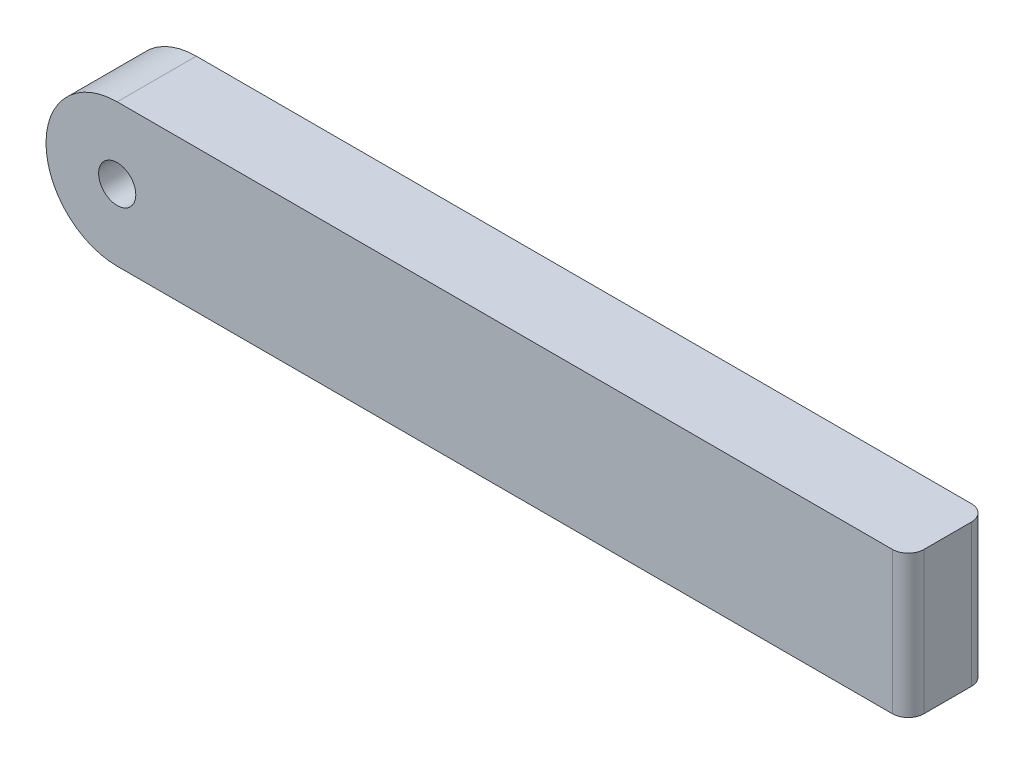
ISO-10303-21;
HEADER;
FILE_DESCRIPTION(('STEP AP214'),'2;1');
FILE_NAME('part.step','',(''),(''),'','','');
FILE_SCHEMA(('AUTOMOTIVE_DESIGN { 1 0 10303 214 1 1 1 1 }'));
ENDSEC;
DATA;
#1=APPLICATION_CONTEXT('core data for automotive mechanical design processes');
#2=APPLICATION_PROTOCOL_DEFINITION('international standard','automotive_design',2000,#1);
#3=PRODUCT_CONTEXT('',#1,'mechanical');
#4=PRODUCT('Part','Part','',(#3));
#5=PRODUCT_RELATED_PRODUCT_CATEGORY('part','',(#4));
#6=PRODUCT_DEFINITION_FORMATION('','',#4);
#7=PRODUCT_DEFINITION_CONTEXT('part definition',#1,'design');
#8=PRODUCT_DEFINITION('design','',#6,#7);
#9=PRODUCT_DEFINITION_SHAPE('','',#8);
#10=(LENGTH_UNIT() NAMED_UNIT(*) SI_UNIT(.MILLI.,.METRE.));
#11=(NAMED_UNIT(*) PLANE_ANGLE_UNIT() SI_UNIT($,.RADIAN.));
#12=(NAMED_UNIT(*) SI_UNIT($,.STERADIAN.) SOLID_ANGLE_UNIT());
#13=UNCERTAINTY_MEASURE_WITH_UNIT(LENGTH_MEASURE(1.E-05),#10,'distance_accuracy_value','');
#14=(GEOMETRIC_REPRESENTATION_CONTEXT(3) GLOBAL_UNCERTAINTY_ASSIGNED_CONTEXT((#13)) GLOBAL_UNIT_ASSIGNED_CONTEXT((#10,
#11,#12)) REPRESENTATION_CONTEXT('',''));
#15=CARTESIAN_POINT('',(0.,0.,0.));
#16=DIRECTION('',(0.,0.,1.));
#17=DIRECTION('',(1.,0.,0.));
#18=AXIS2_PLACEMENT_3D('',#15,#16,#17);
#19=CARTESIAN_POINT('',(0.,0.,10.));
#20=DIRECTION('',(0.,0.,1.));
#21=DIRECTION('',(1.,0.,0.));
#22=AXIS2_PLACEMENT_3D('',#19,#20,#21);
#23=PLANE('',#22);
#24=DIRECTION('',(1.,0.,0.));
#25=VECTOR('',#24,1.);
#26=CARTESIAN_POINT('',(0.,-9.,10.));
#27=LINE('',#26,#25);
#28=CARTESIAN_POINT('',(0.,-9.,10.));
#29=VERTEX_POINT('',#28);
#30=CARTESIAN_POINT('',(98.,-9.,10.));
#31=VERTEX_POINT('',#30);
#32=EDGE_CURVE('E90',#29,#31,#27,.T.);
#33=ORIENTED_EDGE('',*,*,#32,.T.);
#34=DIRECTION('',(0.,1.,0.));
#35=VECTOR('',#34,1.);
#36=CARTESIAN_POINT('',(98.,9.,10.));
#37=LINE('',#36,#35);
#38=CARTESIAN_POINT('',(98.,9.,10.));
#39=VERTEX_POINT('',#38);
#40=EDGE_CURVE('E11',#31,#39,#37,.T.);
#41=ORIENTED_EDGE('',*,*,#40,.T.);
#42=DIRECTION('',(-1.,0.,0.));
#43=VECTOR('',#42,1.);
#44=CARTESIAN_POINT('',(0.,9.,10.));
#45=LINE('',#44,#43);
#46=CARTESIAN_POINT('',(0.,9.,10.));
#47=VERTEX_POINT('',#46);
#48=EDGE_CURVE('E98',#39,#47,#45,.T.);
#49=ORIENTED_EDGE('',*,*,#48,.T.);
#50=CARTESIAN_POINT('',(0.,0.,10.));
#51=DIRECTION('',(0.,0.,1.));
#52=DIRECTION('',(1.,0.,0.));
#53=AXIS2_PLACEMENT_3D('',#50,#51,#52);
#54=CIRCLE('',#53,9.);
#55=EDGE_CURVE('E99',#47,#29,#54,.T.);
#56=ORIENTED_EDGE('',*,*,#55,.T.);
#57=EDGE_LOOP('',(#33,#41,#49,#56));
#58=FACE_BOUND('',#57,.T.);
#59=CARTESIAN_POINT('',(0.,0.,10.));
#60=DIRECTION('',(0.,0.,1.));
#61=DIRECTION('',(1.,0.,0.));
#62=AXIS2_PLACEMENT_3D('',#59,#60,#61);
#63=CIRCLE('',#62,2.35);
#64=CARTESIAN_POINT('',(2.35,0.,10.));
#65=VERTEX_POINT('',#64);
#66=EDGE_CURVE('E149',#65,#65,#63,.T.);
#67=ORIENTED_EDGE('',*,*,#66,.F.);
#68=EDGE_LOOP('',(#67));
#69=FACE_BOUND('',#68,.T.);
#70=ADVANCED_FACE('F37',(#58,#69),#23,.T.);
#71=CARTESIAN_POINT('',(0.,0.,0.));
#72=DIRECTION('',(0.,0.,1.));
#73=DIRECTION('',(1.,0.,0.));
#74=AXIS2_PLACEMENT_3D('',#71,#72,#73);
#75=PLANE('',#74);
#76=DIRECTION('',(-1.,0.,0.));
#77=VECTOR('',#76,1.);
#78=CARTESIAN_POINT('',(0.,9.,0.));
#79=LINE('',#78,#77);
#80=CARTESIAN_POINT('',(98.,9.,0.));
#81=VERTEX_POINT('',#80);
#82=CARTESIAN_POINT('',(0.,9.,0.));
#83=VERTEX_POINT('',#82);
#84=EDGE_CURVE('E107',#81,#83,#79,.T.);
#85=ORIENTED_EDGE('',*,*,#84,.F.);
#86=DIRECTION('',(0.,1.,0.));
#87=VECTOR('',#86,1.);
#88=CARTESIAN_POINT('',(98.,0.,0.));
#89=LINE('',#88,#87);
#90=CARTESIAN_POINT('',(98.,-9.,0.));
#91=VERTEX_POINT('',#90);
#92=EDGE_CURVE('E60',#81,#91,#89,.F.);
#93=ORIENTED_EDGE('',*,*,#92,.T.);
#94=DIRECTION('',(1.,0.,0.));
#95=VECTOR('',#94,1.);
#96=CARTESIAN_POINT('',(0.,-9.,0.));
#97=LINE('',#96,#95);
#98=CARTESIAN_POINT('',(0.,-9.,0.));
#99=VERTEX_POINT('',#98);
#100=EDGE_CURVE('E130',#99,#91,#97,.T.);
#101=ORIENTED_EDGE('',*,*,#100,.F.);
#102=CARTESIAN_POINT('',(0.,0.,0.));
#103=DIRECTION('',(0.,0.,1.));
#104=DIRECTION('',(1.,0.,0.));
#105=AXIS2_PLACEMENT_3D('',#102,#103,#104);
#106=CIRCLE('',#105,9.);
#107=EDGE_CURVE('E111',#83,#99,#106,.T.);
#108=ORIENTED_EDGE('',*,*,#107,.F.);
#109=EDGE_LOOP('',(#85,#93,#101,#108));
#110=FACE_BOUND('',#109,.T.);
#111=CARTESIAN_POINT('',(0.,0.,0.));
#112=DIRECTION('',(0.,0.,1.));
#113=DIRECTION('',(1.,0.,0.));
#114=AXIS2_PLACEMENT_3D('',#111,#112,#113);
#115=CIRCLE('',#114,2.35);
#116=CARTESIAN_POINT('',(2.35,0.,0.));
#117=VERTEX_POINT('',#116);
#118=EDGE_CURVE('E151',#117,#117,#115,.T.);
#119=ORIENTED_EDGE('',*,*,#118,.T.);
#120=EDGE_LOOP('',(#119));
#121=FACE_BOUND('',#120,.T.);
#122=ADVANCED_FACE('F141',(#110,#121),#75,.F.);
#123=CARTESIAN_POINT('',(0.,0.,10.));
#124=DIRECTION('',(0.,0.,-1.));
#125=DIRECTION('',(-1.,0.,0.));
#126=AXIS2_PLACEMENT_3D('',#123,#124,#125);
#127=CYLINDRICAL_SURFACE('',#126,9.);
#128=ORIENTED_EDGE('',*,*,#107,.T.);
#129=DIRECTION('',(0.,0.,-1.));
#130=VECTOR('',#129,1.);
#131=CARTESIAN_POINT('',(0.,-9.,10.));
#132=LINE('',#131,#130);
#133=EDGE_CURVE('E94',#29,#99,#132,.T.);
#134=ORIENTED_EDGE('',*,*,#133,.F.);
#135=ORIENTED_EDGE('',*,*,#55,.F.);
#136=DIRECTION('',(0.,0.,-1.));
#137=VECTOR('',#136,1.);
#138=CARTESIAN_POINT('',(0.,9.,10.));
#139=LINE('',#138,#137);
#140=EDGE_CURVE('E147',#47,#83,#139,.T.);
#141=ORIENTED_EDGE('',*,*,#140,.T.);
#142=EDGE_LOOP('',(#128,#134,#135,#141));
#143=FACE_BOUND('',#142,.T.);
#144=ADVANCED_FACE('F109',(#143),#127,.T.);
#145=CARTESIAN_POINT('',(0.,-9.,10.));
#146=DIRECTION('',(0.,1.,0.));
#147=DIRECTION('',(0.,0.,1.));
#148=AXIS2_PLACEMENT_3D('',#145,#146,#147);
#149=PLANE('',#148);
#150=ORIENTED_EDGE('',*,*,#100,.T.);
#151=CARTESIAN_POINT('',(98.,-9.,2.));
#152=DIRECTION('',(0.,1.,0.));
#153=DIRECTION('',(0.,0.,1.));
#154=AXIS2_PLACEMENT_3D('',#151,#152,#153);
#155=CIRCLE('',#154,2.);
#156=CARTESIAN_POINT('',(100.,-9.,2.));
#157=VERTEX_POINT('',#156);
#158=EDGE_CURVE('E45',#91,#157,#155,.F.);
#159=ORIENTED_EDGE('',*,*,#158,.T.);
#160=DIRECTION('',(0.,0.,-1.));
#161=VECTOR('',#160,1.);
#162=CARTESIAN_POINT('',(100.,-9.,10.));
#163=LINE('',#162,#161);
#164=CARTESIAN_POINT('',(100.,-9.,8.));
#165=VERTEX_POINT('',#164);
#166=EDGE_CURVE('E113',#165,#157,#163,.T.);
#167=ORIENTED_EDGE('',*,*,#166,.F.);
#168=CARTESIAN_POINT('',(98.,-9.,8.));
#169=DIRECTION('',(0.,1.,0.));
#170=DIRECTION('',(0.,0.,1.));
#171=AXIS2_PLACEMENT_3D('',#168,#169,#170);
#172=CIRCLE('',#171,2.);
#173=EDGE_CURVE('E52',#165,#31,#172,.F.);
#174=ORIENTED_EDGE('',*,*,#173,.T.);
#175=ORIENTED_EDGE('',*,*,#32,.F.);
#176=ORIENTED_EDGE('',*,*,#133,.T.);
#177=EDGE_LOOP('',(#150,#159,#167,#174,#175,#176));
#178=FACE_BOUND('',#177,.T.);
#179=ADVANCED_FACE('F92',(#178),#149,.F.);
#180=CARTESIAN_POINT('',(100.,9.,10.));
#181=DIRECTION('',(-1.,0.,0.));
#182=DIRECTION('',(0.,0.,1.));
#183=AXIS2_PLACEMENT_3D('',#180,#181,#182);
#184=PLANE('',#183);
#185=ORIENTED_EDGE('',*,*,#166,.T.);
#186=DIRECTION('',(0.,1.,0.));
#187=VECTOR('',#186,1.);
#188=CARTESIAN_POINT('',(100.,9.,2.));
#189=LINE('',#188,#187);
#190=CARTESIAN_POINT('',(100.,9.,2.));
#191=VERTEX_POINT('',#190);
#192=EDGE_CURVE('E115',#157,#191,#189,.T.);
#193=ORIENTED_EDGE('',*,*,#192,.T.);
#194=DIRECTION('',(0.,0.,-1.));
#195=VECTOR('',#194,1.);
#196=CARTESIAN_POINT('',(100.,9.,10.));
#197=LINE('',#196,#195);
#198=CARTESIAN_POINT('',(100.,9.,8.));
#199=VERTEX_POINT('',#198);
#200=EDGE_CURVE('E118',#199,#191,#197,.T.);
#201=ORIENTED_EDGE('',*,*,#200,.F.);
#202=DIRECTION('',(0.,1.,0.));
#203=VECTOR('',#202,1.);
#204=CARTESIAN_POINT('',(100.,-9.,8.));
#205=LINE('',#204,#203);
#206=EDGE_CURVE('E112',#199,#165,#205,.F.);
#207=ORIENTED_EDGE('',*,*,#206,.T.);
#208=EDGE_LOOP('',(#185,#193,#201,#207));
#209=FACE_BOUND('',#208,.T.);
#210=ADVANCED_FACE('F134',(#209),#184,.F.);
#211=CARTESIAN_POINT('',(0.,9.,10.));
#212=DIRECTION('',(0.,-1.,0.));
#213=DIRECTION('',(0.,0.,-1.));
#214=AXIS2_PLACEMENT_3D('',#211,#212,#213);
#215=PLANE('',#214);
#216=ORIENTED_EDGE('',*,*,#200,.T.);
#217=CARTESIAN_POINT('',(98.,9.,2.));
#218=DIRECTION('',(0.,-1.,0.));
#219=DIRECTION('',(0.,0.,-1.));
#220=AXIS2_PLACEMENT_3D('',#217,#218,#219);
#221=CIRCLE('',#220,2.);
#222=EDGE_CURVE('E126',#191,#81,#221,.F.);
#223=ORIENTED_EDGE('',*,*,#222,.T.);
#224=ORIENTED_EDGE('',*,*,#84,.T.);
#225=ORIENTED_EDGE('',*,*,#140,.F.);
#226=ORIENTED_EDGE('',*,*,#48,.F.);
#227=CARTESIAN_POINT('',(98.,9.,8.));
#228=DIRECTION('',(0.,-1.,0.));
#229=DIRECTION('',(0.,0.,-1.));
#230=AXIS2_PLACEMENT_3D('',#227,#228,#229);
#231=CIRCLE('',#230,2.);
#232=EDGE_CURVE('E124',#39,#199,#231,.F.);
#233=ORIENTED_EDGE('',*,*,#232,.T.);
#234=EDGE_LOOP('',(#216,#223,#224,#225,#226,#233));
#235=FACE_BOUND('',#234,.T.);
#236=ADVANCED_FACE('F140',(#235),#215,.F.);
#237=CARTESIAN_POINT('',(0.,0.,10.));
#238=DIRECTION('',(0.,0.,-1.));
#239=DIRECTION('',(-1.,0.,0.));
#240=AXIS2_PLACEMENT_3D('',#237,#238,#239);
#241=CYLINDRICAL_SURFACE('',#240,2.35);
#242=ORIENTED_EDGE('',*,*,#66,.T.);
#243=EDGE_LOOP('',(#242));
#244=FACE_BOUND('',#243,.T.);
#245=ORIENTED_EDGE('',*,*,#118,.F.);
#246=EDGE_LOOP('',(#245));
#247=FACE_BOUND('',#246,.T.);
#248=ADVANCED_FACE('F159',(#244,#247),#241,.F.);
#249=CARTESIAN_POINT('',(98.,9.,2.));
#250=DIRECTION('',(0.,1.,0.));
#251=DIRECTION('',(0.,0.,1.));
#252=AXIS2_PLACEMENT_3D('',#249,#250,#251);
#253=CYLINDRICAL_SURFACE('',#252,2.);
#254=ORIENTED_EDGE('',*,*,#158,.F.);
#255=ORIENTED_EDGE('',*,*,#92,.F.);
#256=ORIENTED_EDGE('',*,*,#222,.F.);
#257=ORIENTED_EDGE('',*,*,#192,.F.);
#258=EDGE_LOOP('',(#254,#255,#256,#257));
#259=FACE_BOUND('',#258,.T.);
#260=ADVANCED_FACE('F138',(#259),#253,.T.);
#261=CARTESIAN_POINT('',(98.,0.,8.));
#262=DIRECTION('',(0.,-1.,0.));
#263=DIRECTION('',(0.,0.,-1.));
#264=AXIS2_PLACEMENT_3D('',#261,#262,#263);
#265=CYLINDRICAL_SURFACE('',#264,2.);
#266=ORIENTED_EDGE('',*,*,#173,.F.);
#267=ORIENTED_EDGE('',*,*,#206,.F.);
#268=ORIENTED_EDGE('',*,*,#232,.F.);
#269=ORIENTED_EDGE('',*,*,#40,.F.);
#270=EDGE_LOOP('',(#266,#267,#268,#269));
#271=FACE_BOUND('',#270,.T.);
#272=ADVANCED_FACE('F39',(#271),#265,.T.);
#273=CLOSED_SHELL('',(#70,#122,#144,#179,#210,#236,#248,#260,#272));
#274=MANIFOLD_SOLID_BREP('B2',#273);
#275=ADVANCED_BREP_SHAPE_REPRESENTATION('',(#18,#274),#14);
#276=SHAPE_DEFINITION_REPRESENTATION(#9,#275);
ENDSEC;
END-ISO-10303-21;
